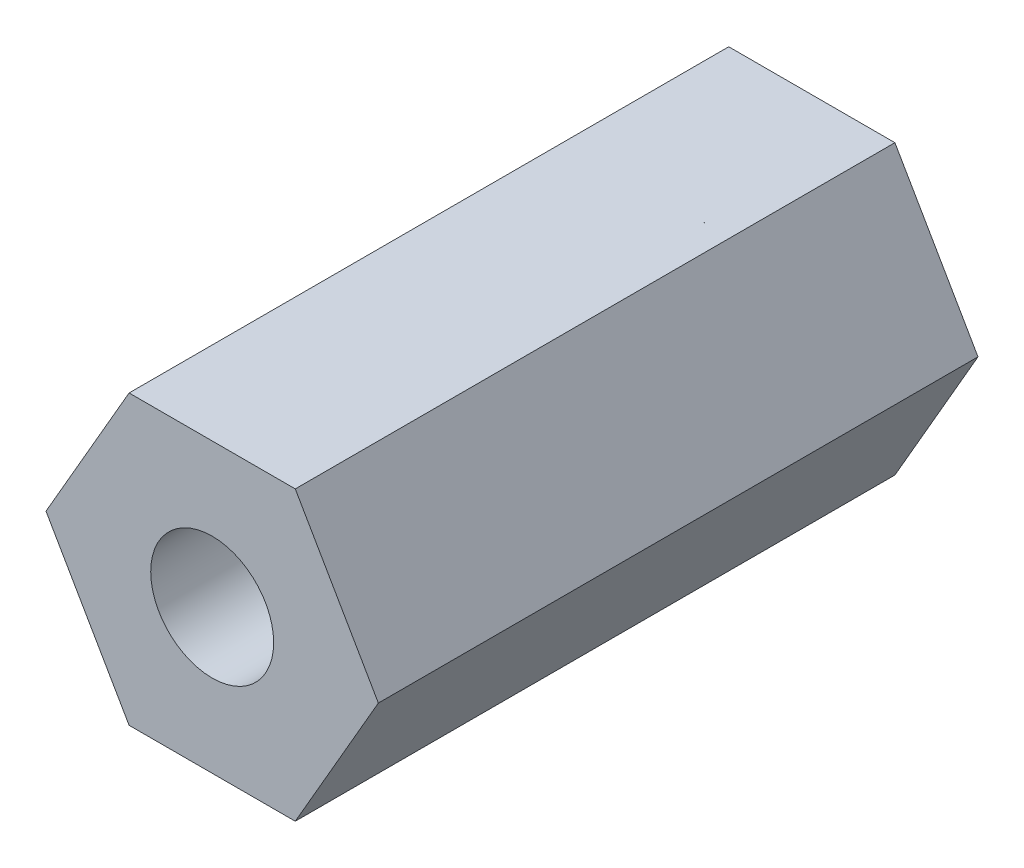
ISO-10303-21;
HEADER;
FILE_DESCRIPTION(('STEP AP214'),'2;1');
FILE_NAME('part.step','',(''),(''),'','','');
FILE_SCHEMA(('AUTOMOTIVE_DESIGN { 1 0 10303 214 1 1 1 1 }'));
ENDSEC;
DATA;
#1=APPLICATION_CONTEXT('core data for automotive mechanical design processes');
#2=APPLICATION_PROTOCOL_DEFINITION('international standard','automotive_design',2000,#1);
#3=PRODUCT_CONTEXT('',#1,'mechanical');
#4=PRODUCT('Part','Part','',(#3));
#5=PRODUCT_RELATED_PRODUCT_CATEGORY('part','',(#4));
#6=PRODUCT_DEFINITION_FORMATION('','',#4);
#7=PRODUCT_DEFINITION_CONTEXT('part definition',#1,'design');
#8=PRODUCT_DEFINITION('design','',#6,#7);
#9=PRODUCT_DEFINITION_SHAPE('','',#8);
#10=(LENGTH_UNIT() NAMED_UNIT(*) SI_UNIT(.MILLI.,.METRE.));
#11=(NAMED_UNIT(*) PLANE_ANGLE_UNIT() SI_UNIT($,.RADIAN.));
#12=(NAMED_UNIT(*) SI_UNIT($,.STERADIAN.) SOLID_ANGLE_UNIT());
#13=UNCERTAINTY_MEASURE_WITH_UNIT(LENGTH_MEASURE(1.E-05),#10,'distance_accuracy_value','');
#14=(GEOMETRIC_REPRESENTATION_CONTEXT(3) GLOBAL_UNCERTAINTY_ASSIGNED_CONTEXT((#13)) GLOBAL_UNIT_ASSIGNED_CONTEXT((#10,
#11,#12)) REPRESENTATION_CONTEXT('',''));
#15=CARTESIAN_POINT('',(0.,0.,0.));
#16=DIRECTION('',(0.,0.,1.));
#17=DIRECTION('',(1.,0.,0.));
#18=AXIS2_PLACEMENT_3D('',#15,#16,#17);
#19=CARTESIAN_POINT('',(2.7712812921102,-4.8,20.));
#20=DIRECTION('',(-0.866025403784439,0.5,0.));
#21=DIRECTION('',(-0.5,-0.866025403784439,0.));
#22=AXIS2_PLACEMENT_3D('',#19,#20,#21);
#23=PLANE('',#22);
#24=DIRECTION('',(0.5,0.866025403784439,0.));
#25=VECTOR('',#24,1.);
#26=CARTESIAN_POINT('',(2.7712812921102,-4.8,0.));
#27=LINE('',#26,#25);
#28=CARTESIAN_POINT('',(2.7712812921102,-4.8,0.));
#29=VERTEX_POINT('',#28);
#30=CARTESIAN_POINT('',(5.54256258422041,0.,0.));
#31=VERTEX_POINT('',#30);
#32=EDGE_CURVE('E120',#29,#31,#27,.T.);
#33=ORIENTED_EDGE('',*,*,#32,.T.);
#34=DIRECTION('',(0.,0.,-1.));
#35=VECTOR('',#34,1.);
#36=CARTESIAN_POINT('',(5.54256258422041,0.,20.));
#37=LINE('',#36,#35);
#38=CARTESIAN_POINT('',(5.54256258422041,0.,20.));
#39=VERTEX_POINT('',#38);
#40=EDGE_CURVE('E11',#39,#31,#37,.T.);
#41=ORIENTED_EDGE('',*,*,#40,.F.);
#42=DIRECTION('',(0.5,0.866025403784439,0.));
#43=VECTOR('',#42,1.);
#44=CARTESIAN_POINT('',(2.7712812921102,-4.8,20.));
#45=LINE('',#44,#43);
#46=CARTESIAN_POINT('',(2.7712812921102,-4.8,20.));
#47=VERTEX_POINT('',#46);
#48=EDGE_CURVE('E131',#47,#39,#45,.T.);
#49=ORIENTED_EDGE('',*,*,#48,.F.);
#50=DIRECTION('',(0.,0.,-1.));
#51=VECTOR('',#50,1.);
#52=CARTESIAN_POINT('',(2.7712812921102,-4.8,20.));
#53=LINE('',#52,#51);
#54=EDGE_CURVE('E116',#47,#29,#53,.T.);
#55=ORIENTED_EDGE('',*,*,#54,.T.);
#56=EDGE_LOOP('',(#33,#41,#49,#55));
#57=FACE_BOUND('',#56,.T.);
#58=ADVANCED_FACE('F36',(#57),#23,.F.);
#59=CARTESIAN_POINT('',(5.54256258422041,0.,20.));
#60=DIRECTION('',(-0.866025403784439,-0.5,0.));
#61=DIRECTION('',(0.5,-0.866025403784439,0.));
#62=AXIS2_PLACEMENT_3D('',#59,#60,#61);
#63=PLANE('',#62);
#64=DIRECTION('',(-0.5,0.866025403784439,0.));
#65=VECTOR('',#64,1.);
#66=CARTESIAN_POINT('',(5.54256258422041,0.,0.));
#67=LINE('',#66,#65);
#68=CARTESIAN_POINT('',(2.7712812921102,4.8,0.));
#69=VERTEX_POINT('',#68);
#70=EDGE_CURVE('E123',#31,#69,#67,.T.);
#71=ORIENTED_EDGE('',*,*,#70,.T.);
#72=DIRECTION('',(0.,0.,-1.));
#73=VECTOR('',#72,1.);
#74=CARTESIAN_POINT('',(2.7712812921102,4.8,20.));
#75=LINE('',#74,#73);
#76=CARTESIAN_POINT('',(2.7712812921102,4.8,20.));
#77=VERTEX_POINT('',#76);
#78=EDGE_CURVE('E44',#77,#69,#75,.T.);
#79=ORIENTED_EDGE('',*,*,#78,.F.);
#80=DIRECTION('',(-0.5,0.866025403784439,0.));
#81=VECTOR('',#80,1.);
#82=CARTESIAN_POINT('',(5.54256258422041,0.,20.));
#83=LINE('',#82,#81);
#84=EDGE_CURVE('E89',#39,#77,#83,.T.);
#85=ORIENTED_EDGE('',*,*,#84,.F.);
#86=ORIENTED_EDGE('',*,*,#40,.T.);
#87=EDGE_LOOP('',(#71,#79,#85,#86));
#88=FACE_BOUND('',#87,.T.);
#89=ADVANCED_FACE('F156',(#88),#63,.F.);
#90=CARTESIAN_POINT('',(2.7712812921102,4.8,20.));
#91=DIRECTION('',(0.,-1.,0.));
#92=DIRECTION('',(1.,0.,0.));
#93=AXIS2_PLACEMENT_3D('',#90,#91,#92);
#94=PLANE('',#93);
#95=DIRECTION('',(-1.,0.,0.));
#96=VECTOR('',#95,1.);
#97=CARTESIAN_POINT('',(2.7712812921102,4.8,0.));
#98=LINE('',#97,#96);
#99=CARTESIAN_POINT('',(-2.7712812921102,4.8,0.));
#100=VERTEX_POINT('',#99);
#101=EDGE_CURVE('E126',#69,#100,#98,.T.);
#102=ORIENTED_EDGE('',*,*,#101,.T.);
#103=DIRECTION('',(0.,0.,-1.));
#104=VECTOR('',#103,1.);
#105=CARTESIAN_POINT('',(-2.7712812921102,4.8,20.));
#106=LINE('',#105,#104);
#107=CARTESIAN_POINT('',(-2.7712812921102,4.8,20.));
#108=VERTEX_POINT('',#107);
#109=EDGE_CURVE('E111',#108,#100,#106,.T.);
#110=ORIENTED_EDGE('',*,*,#109,.F.);
#111=DIRECTION('',(-1.,0.,0.));
#112=VECTOR('',#111,1.);
#113=CARTESIAN_POINT('',(2.7712812921102,4.8,20.));
#114=LINE('',#113,#112);
#115=EDGE_CURVE('E102',#77,#108,#114,.T.);
#116=ORIENTED_EDGE('',*,*,#115,.F.);
#117=ORIENTED_EDGE('',*,*,#78,.T.);
#118=EDGE_LOOP('',(#102,#110,#116,#117));
#119=FACE_BOUND('',#118,.T.);
#120=ADVANCED_FACE('F137',(#119),#94,.F.);
#121=CARTESIAN_POINT('',(-2.7712812921102,4.8,20.));
#122=DIRECTION('',(0.866025403784439,-0.5,0.));
#123=DIRECTION('',(0.5,0.866025403784439,0.));
#124=AXIS2_PLACEMENT_3D('',#121,#122,#123);
#125=PLANE('',#124);
#126=DIRECTION('',(-0.5,-0.866025403784439,0.));
#127=VECTOR('',#126,1.);
#128=CARTESIAN_POINT('',(-2.7712812921102,4.8,0.));
#129=LINE('',#128,#127);
#130=CARTESIAN_POINT('',(-5.54256258422041,0.,0.));
#131=VERTEX_POINT('',#130);
#132=EDGE_CURVE('E110',#100,#131,#129,.T.);
#133=ORIENTED_EDGE('',*,*,#132,.T.);
#134=DIRECTION('',(0.,0.,-1.));
#135=VECTOR('',#134,1.);
#136=CARTESIAN_POINT('',(-5.54256258422041,0.,20.));
#137=LINE('',#136,#135);
#138=CARTESIAN_POINT('',(-5.54256258422041,0.,20.));
#139=VERTEX_POINT('',#138);
#140=EDGE_CURVE('E107',#139,#131,#137,.T.);
#141=ORIENTED_EDGE('',*,*,#140,.F.);
#142=DIRECTION('',(-0.5,-0.866025403784439,0.));
#143=VECTOR('',#142,1.);
#144=CARTESIAN_POINT('',(-2.7712812921102,4.8,20.));
#145=LINE('',#144,#143);
#146=EDGE_CURVE('E96',#108,#139,#145,.T.);
#147=ORIENTED_EDGE('',*,*,#146,.F.);
#148=ORIENTED_EDGE('',*,*,#109,.T.);
#149=EDGE_LOOP('',(#133,#141,#147,#148));
#150=FACE_BOUND('',#149,.T.);
#151=ADVANCED_FACE('F108',(#150),#125,.F.);
#152=CARTESIAN_POINT('',(-5.54256258422041,0.,20.));
#153=DIRECTION('',(0.866025403784439,0.5,0.));
#154=DIRECTION('',(-0.5,0.866025403784439,0.));
#155=AXIS2_PLACEMENT_3D('',#152,#153,#154);
#156=PLANE('',#155);
#157=DIRECTION('',(0.5,-0.866025403784439,0.));
#158=VECTOR('',#157,1.);
#159=CARTESIAN_POINT('',(-5.54256258422041,0.,0.));
#160=LINE('',#159,#158);
#161=CARTESIAN_POINT('',(-2.77128129211021,-4.8,0.));
#162=VERTEX_POINT('',#161);
#163=EDGE_CURVE('E75',#131,#162,#160,.T.);
#164=ORIENTED_EDGE('',*,*,#163,.T.);
#165=DIRECTION('',(0.,0.,-1.));
#166=VECTOR('',#165,1.);
#167=CARTESIAN_POINT('',(-2.77128129211021,-4.8,20.));
#168=LINE('',#167,#166);
#169=CARTESIAN_POINT('',(-2.77128129211021,-4.8,20.));
#170=VERTEX_POINT('',#169);
#171=EDGE_CURVE('E112',#170,#162,#168,.T.);
#172=ORIENTED_EDGE('',*,*,#171,.F.);
#173=DIRECTION('',(0.5,-0.866025403784439,0.));
#174=VECTOR('',#173,1.);
#175=CARTESIAN_POINT('',(-5.54256258422041,0.,20.));
#176=LINE('',#175,#174);
#177=EDGE_CURVE('E100',#139,#170,#176,.T.);
#178=ORIENTED_EDGE('',*,*,#177,.F.);
#179=ORIENTED_EDGE('',*,*,#140,.T.);
#180=EDGE_LOOP('',(#164,#172,#178,#179));
#181=FACE_BOUND('',#180,.T.);
#182=ADVANCED_FACE('F114',(#181),#156,.F.);
#183=CARTESIAN_POINT('',(-2.77128129211021,-4.8,20.));
#184=DIRECTION('',(0.,1.,0.));
#185=DIRECTION('',(-1.,0.,0.));
#186=AXIS2_PLACEMENT_3D('',#183,#184,#185);
#187=PLANE('',#186);
#188=DIRECTION('',(1.,0.,0.));
#189=VECTOR('',#188,1.);
#190=CARTESIAN_POINT('',(-2.77128129211021,-4.8,0.));
#191=LINE('',#190,#189);
#192=EDGE_CURVE('E81',#162,#29,#191,.T.);
#193=ORIENTED_EDGE('',*,*,#192,.T.);
#194=ORIENTED_EDGE('',*,*,#54,.F.);
#195=DIRECTION('',(1.,0.,0.));
#196=VECTOR('',#195,1.);
#197=CARTESIAN_POINT('',(-2.77128129211021,-4.8,20.));
#198=LINE('',#197,#196);
#199=EDGE_CURVE('E52',#170,#47,#198,.T.);
#200=ORIENTED_EDGE('',*,*,#199,.F.);
#201=ORIENTED_EDGE('',*,*,#171,.T.);
#202=EDGE_LOOP('',(#193,#194,#200,#201));
#203=FACE_BOUND('',#202,.T.);
#204=ADVANCED_FACE('F144',(#203),#187,.F.);
#205=CARTESIAN_POINT('',(0.,0.,20.));
#206=DIRECTION('',(0.,0.,1.));
#207=DIRECTION('',(1.,0.,0.));
#208=AXIS2_PLACEMENT_3D('',#205,#206,#207);
#209=PLANE('',#208);
#210=CARTESIAN_POINT('',(0.,0.,20.));
#211=DIRECTION('',(0.,0.,1.));
#212=DIRECTION('',(1.,0.,0.));
#213=AXIS2_PLACEMENT_3D('',#210,#211,#212);
#214=CIRCLE('',#213,2.05);
#215=CARTESIAN_POINT('',(2.05,0.,20.));
#216=VERTEX_POINT('',#215);
#217=EDGE_CURVE('E124',#216,#216,#214,.F.);
#218=ORIENTED_EDGE('',*,*,#217,.T.);
#219=EDGE_LOOP('',(#218));
#220=FACE_BOUND('',#219,.T.);
#221=ORIENTED_EDGE('',*,*,#48,.T.);
#222=ORIENTED_EDGE('',*,*,#84,.T.);
#223=ORIENTED_EDGE('',*,*,#115,.T.);
#224=ORIENTED_EDGE('',*,*,#146,.T.);
#225=ORIENTED_EDGE('',*,*,#177,.T.);
#226=ORIENTED_EDGE('',*,*,#199,.T.);
#227=EDGE_LOOP('',(#221,#222,#223,#224,#225,#226));
#228=FACE_BOUND('',#227,.T.);
#229=ADVANCED_FACE('F98',(#220,#228),#209,.T.);
#230=CARTESIAN_POINT('',(0.,0.,0.));
#231=DIRECTION('',(0.,0.,1.));
#232=DIRECTION('',(1.,0.,0.));
#233=AXIS2_PLACEMENT_3D('',#230,#231,#232);
#234=PLANE('',#233);
#235=CARTESIAN_POINT('',(0.,0.,0.));
#236=DIRECTION('',(0.,0.,-1.));
#237=DIRECTION('',(-1.,0.,0.));
#238=AXIS2_PLACEMENT_3D('',#235,#236,#237);
#239=CIRCLE('',#238,2.05);
#240=CARTESIAN_POINT('',(-2.05,0.,0.));
#241=VERTEX_POINT('',#240);
#242=EDGE_CURVE('E209',#241,#241,#239,.T.);
#243=ORIENTED_EDGE('',*,*,#242,.F.);
#244=EDGE_LOOP('',(#243));
#245=FACE_BOUND('',#244,.T.);
#246=ORIENTED_EDGE('',*,*,#32,.F.);
#247=ORIENTED_EDGE('',*,*,#192,.F.);
#248=ORIENTED_EDGE('',*,*,#163,.F.);
#249=ORIENTED_EDGE('',*,*,#132,.F.);
#250=ORIENTED_EDGE('',*,*,#101,.F.);
#251=ORIENTED_EDGE('',*,*,#70,.F.);
#252=EDGE_LOOP('',(#246,#247,#248,#249,#250,#251));
#253=FACE_BOUND('',#252,.T.);
#254=ADVANCED_FACE('F140',(#245,#253),#234,.F.);
#255=CARTESIAN_POINT('',(0.,0.,25.7982756057297));
#256=DIRECTION('',(0.,0.,-1.));
#257=DIRECTION('',(-1.,0.,0.));
#258=AXIS2_PLACEMENT_3D('',#255,#256,#257);
#259=CYLINDRICAL_SURFACE('',#258,2.05);
#260=ORIENTED_EDGE('',*,*,#242,.T.);
#261=EDGE_LOOP('',(#260));
#262=FACE_BOUND('',#261,.T.);
#263=ORIENTED_EDGE('',*,*,#217,.F.);
#264=EDGE_LOOP('',(#263));
#265=FACE_BOUND('',#264,.T.);
#266=ADVANCED_FACE('F193',(#262,#265),#259,.F.);
#267=CLOSED_SHELL('',(#58,#89,#120,#151,#182,#204,#229,#254,#266));
#268=MANIFOLD_SOLID_BREP('B2',#267);
#269=ADVANCED_BREP_SHAPE_REPRESENTATION('',(#18,#268),#14);
#270=SHAPE_DEFINITION_REPRESENTATION(#9,#269);
ENDSEC;
END-ISO-10303-21;
